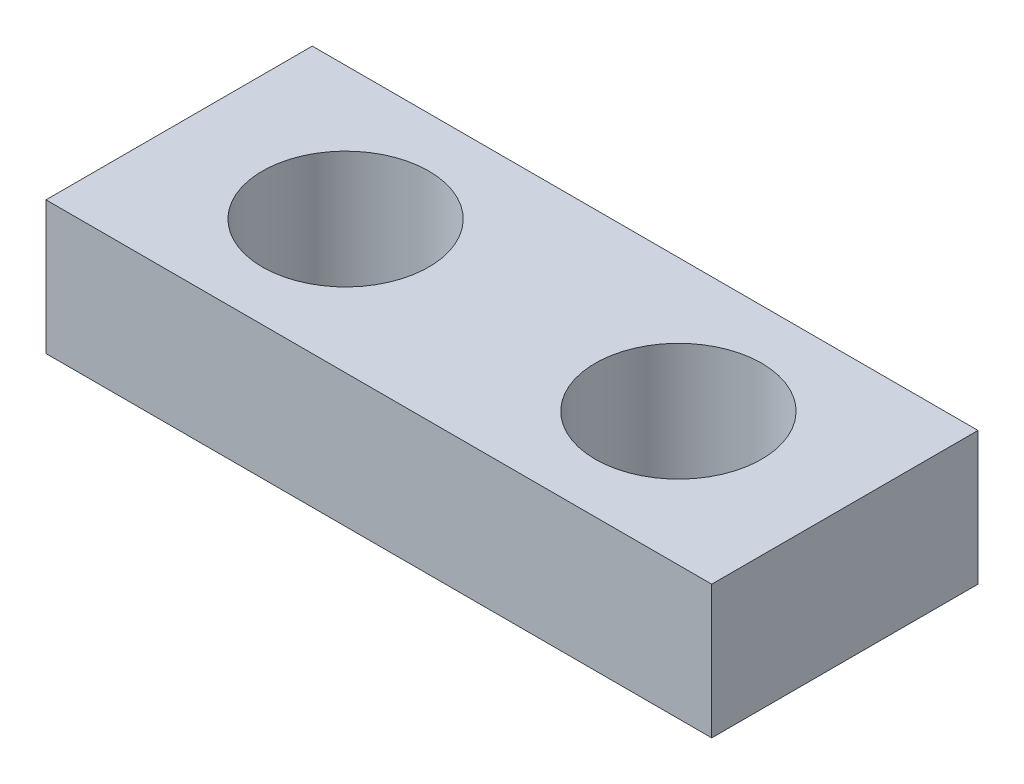
ISO-10303-21;
HEADER;
FILE_DESCRIPTION(('STEP AP214'),'2;1');
FILE_NAME('part.step','',(''),(''),'','','');
FILE_SCHEMA(('AUTOMOTIVE_DESIGN { 1 0 10303 214 1 1 1 1 }'));
ENDSEC;
DATA;
#1=APPLICATION_CONTEXT('core data for automotive mechanical design processes');
#2=APPLICATION_PROTOCOL_DEFINITION('international standard','automotive_design',2000,#1);
#3=PRODUCT_CONTEXT('',#1,'mechanical');
#4=PRODUCT('Part','Part','',(#3));
#5=PRODUCT_RELATED_PRODUCT_CATEGORY('part','',(#4));
#6=PRODUCT_DEFINITION_FORMATION('','',#4);
#7=PRODUCT_DEFINITION_CONTEXT('part definition',#1,'design');
#8=PRODUCT_DEFINITION('design','',#6,#7);
#9=PRODUCT_DEFINITION_SHAPE('','',#8);
#10=(LENGTH_UNIT() NAMED_UNIT(*) SI_UNIT(.MILLI.,.METRE.));
#11=(NAMED_UNIT(*) PLANE_ANGLE_UNIT() SI_UNIT($,.RADIAN.));
#12=(NAMED_UNIT(*) SI_UNIT($,.STERADIAN.) SOLID_ANGLE_UNIT());
#13=UNCERTAINTY_MEASURE_WITH_UNIT(LENGTH_MEASURE(1.E-05),#10,'distance_accuracy_value','');
#14=(GEOMETRIC_REPRESENTATION_CONTEXT(3) GLOBAL_UNCERTAINTY_ASSIGNED_CONTEXT((#13)) GLOBAL_UNIT_ASSIGNED_CONTEXT((#10,
#11,#12)) REPRESENTATION_CONTEXT('',''));
#15=CARTESIAN_POINT('',(0.,0.,0.));
#16=DIRECTION('',(0.,0.,1.));
#17=DIRECTION('',(1.,0.,0.));
#18=AXIS2_PLACEMENT_3D('',#15,#16,#17);
#19=CARTESIAN_POINT('',(0.,25.4,0.));
#20=DIRECTION('',(1.,0.,0.));
#21=DIRECTION('',(0.,0.,-1.));
#22=AXIS2_PLACEMENT_3D('',#19,#20,#21);
#23=PLANE('',#22);
#24=DIRECTION('',(0.,0.,1.));
#25=VECTOR('',#24,1.);
#26=CARTESIAN_POINT('',(0.,0.,0.));
#27=LINE('',#26,#25);
#28=CARTESIAN_POINT('',(0.,0.,-50.8));
#29=VERTEX_POINT('',#28);
#30=CARTESIAN_POINT('',(0.,0.,0.));
#31=VERTEX_POINT('',#30);
#32=EDGE_CURVE('E95',#29,#31,#27,.T.);
#33=ORIENTED_EDGE('',*,*,#32,.T.);
#34=DIRECTION('',(0.,-1.,0.));
#35=VECTOR('',#34,1.);
#36=CARTESIAN_POINT('',(0.,25.4,0.));
#37=LINE('',#36,#35);
#38=CARTESIAN_POINT('',(0.,25.4,0.));
#39=VERTEX_POINT('',#38);
#40=EDGE_CURVE('E11',#39,#31,#37,.T.);
#41=ORIENTED_EDGE('',*,*,#40,.F.);
#42=DIRECTION('',(0.,0.,1.));
#43=VECTOR('',#42,1.);
#44=CARTESIAN_POINT('',(0.,25.4,0.));
#45=LINE('',#44,#43);
#46=CARTESIAN_POINT('',(0.,25.4,-50.8));
#47=VERTEX_POINT('',#46);
#48=EDGE_CURVE('E83',#47,#39,#45,.T.);
#49=ORIENTED_EDGE('',*,*,#48,.F.);
#50=DIRECTION('',(0.,-1.,0.));
#51=VECTOR('',#50,1.);
#52=CARTESIAN_POINT('',(0.,25.4,-50.8));
#53=LINE('',#52,#51);
#54=EDGE_CURVE('E91',#47,#29,#53,.T.);
#55=ORIENTED_EDGE('',*,*,#54,.T.);
#56=EDGE_LOOP('',(#33,#41,#49,#55));
#57=FACE_BOUND('',#56,.T.);
#58=ADVANCED_FACE('F32',(#57),#23,.F.);
#59=CARTESIAN_POINT('',(0.,25.4,0.));
#60=DIRECTION('',(0.,0.,-1.));
#61=DIRECTION('',(-1.,0.,0.));
#62=AXIS2_PLACEMENT_3D('',#59,#60,#61);
#63=PLANE('',#62);
#64=DIRECTION('',(1.,0.,0.));
#65=VECTOR('',#64,1.);
#66=CARTESIAN_POINT('',(0.,0.,0.));
#67=LINE('',#66,#65);
#68=CARTESIAN_POINT('',(127.,0.,0.));
#69=VERTEX_POINT('',#68);
#70=EDGE_CURVE('E87',#31,#69,#67,.T.);
#71=ORIENTED_EDGE('',*,*,#70,.T.);
#72=DIRECTION('',(0.,-1.,0.));
#73=VECTOR('',#72,1.);
#74=CARTESIAN_POINT('',(127.,25.4,0.));
#75=LINE('',#74,#73);
#76=CARTESIAN_POINT('',(127.,25.4,0.));
#77=VERTEX_POINT('',#76);
#78=EDGE_CURVE('E40',#77,#69,#75,.T.);
#79=ORIENTED_EDGE('',*,*,#78,.F.);
#80=DIRECTION('',(1.,0.,0.));
#81=VECTOR('',#80,1.);
#82=CARTESIAN_POINT('',(0.,25.4,0.));
#83=LINE('',#82,#81);
#84=EDGE_CURVE('E78',#39,#77,#83,.T.);
#85=ORIENTED_EDGE('',*,*,#84,.F.);
#86=ORIENTED_EDGE('',*,*,#40,.T.);
#87=EDGE_LOOP('',(#71,#79,#85,#86));
#88=FACE_BOUND('',#87,.T.);
#89=ADVANCED_FACE('F86',(#88),#63,.F.);
#90=CARTESIAN_POINT('',(127.,25.4,0.));
#91=DIRECTION('',(-1.,0.,0.));
#92=DIRECTION('',(0.,0.,1.));
#93=AXIS2_PLACEMENT_3D('',#90,#91,#92);
#94=PLANE('',#93);
#95=DIRECTION('',(0.,0.,-1.));
#96=VECTOR('',#95,1.);
#97=CARTESIAN_POINT('',(127.,0.,0.));
#98=LINE('',#97,#96);
#99=CARTESIAN_POINT('',(127.,0.,-50.8));
#100=VERTEX_POINT('',#99);
#101=EDGE_CURVE('E65',#69,#100,#98,.T.);
#102=ORIENTED_EDGE('',*,*,#101,.T.);
#103=DIRECTION('',(0.,-1.,0.));
#104=VECTOR('',#103,1.);
#105=CARTESIAN_POINT('',(127.,25.4,-50.8));
#106=LINE('',#105,#104);
#107=CARTESIAN_POINT('',(127.,25.4,-50.8));
#108=VERTEX_POINT('',#107);
#109=EDGE_CURVE('E88',#108,#100,#106,.T.);
#110=ORIENTED_EDGE('',*,*,#109,.F.);
#111=DIRECTION('',(0.,0.,-1.));
#112=VECTOR('',#111,1.);
#113=CARTESIAN_POINT('',(127.,25.4,0.));
#114=LINE('',#113,#112);
#115=EDGE_CURVE('E81',#77,#108,#114,.T.);
#116=ORIENTED_EDGE('',*,*,#115,.F.);
#117=ORIENTED_EDGE('',*,*,#78,.T.);
#118=EDGE_LOOP('',(#102,#110,#116,#117));
#119=FACE_BOUND('',#118,.T.);
#120=ADVANCED_FACE('F89',(#119),#94,.F.);
#121=CARTESIAN_POINT('',(0.,25.4,-50.8));
#122=DIRECTION('',(0.,0.,1.));
#123=DIRECTION('',(1.,0.,0.));
#124=AXIS2_PLACEMENT_3D('',#121,#122,#123);
#125=PLANE('',#124);
#126=DIRECTION('',(-1.,0.,0.));
#127=VECTOR('',#126,1.);
#128=CARTESIAN_POINT('',(0.,0.,-50.8));
#129=LINE('',#128,#127);
#130=EDGE_CURVE('E71',#100,#29,#129,.T.);
#131=ORIENTED_EDGE('',*,*,#130,.T.);
#132=ORIENTED_EDGE('',*,*,#54,.F.);
#133=DIRECTION('',(-1.,0.,0.));
#134=VECTOR('',#133,1.);
#135=CARTESIAN_POINT('',(0.,25.4,-50.8));
#136=LINE('',#135,#134);
#137=EDGE_CURVE('E48',#108,#47,#136,.T.);
#138=ORIENTED_EDGE('',*,*,#137,.F.);
#139=ORIENTED_EDGE('',*,*,#109,.T.);
#140=EDGE_LOOP('',(#131,#132,#138,#139));
#141=FACE_BOUND('',#140,.T.);
#142=ADVANCED_FACE('F103',(#141),#125,.F.);
#143=CARTESIAN_POINT('',(0.,25.4,0.));
#144=DIRECTION('',(0.,-1.,0.));
#145=DIRECTION('',(0.,0.,-1.));
#146=AXIS2_PLACEMENT_3D('',#143,#144,#145);
#147=PLANE('',#146);
#148=CARTESIAN_POINT('',(95.25,25.4,-25.4));
#149=DIRECTION('',(0.,1.,0.));
#150=DIRECTION('',(0.,0.,1.));
#151=AXIS2_PLACEMENT_3D('',#148,#149,#150);
#152=CIRCLE('',#151,15.875);
#153=CARTESIAN_POINT('',(95.25,25.4,-9.525));
#154=VERTEX_POINT('',#153);
#155=EDGE_CURVE('E115',#154,#154,#152,.T.);
#156=ORIENTED_EDGE('',*,*,#155,.F.);
#157=EDGE_LOOP('',(#156));
#158=FACE_BOUND('',#157,.T.);
#159=CARTESIAN_POINT('',(31.75,25.4,-25.4));
#160=DIRECTION('',(0.,1.,0.));
#161=DIRECTION('',(0.,0.,1.));
#162=AXIS2_PLACEMENT_3D('',#159,#160,#161);
#163=CIRCLE('',#162,15.875);
#164=CARTESIAN_POINT('',(31.75,25.4,-9.525));
#165=VERTEX_POINT('',#164);
#166=EDGE_CURVE('E109',#165,#165,#163,.T.);
#167=ORIENTED_EDGE('',*,*,#166,.F.);
#168=EDGE_LOOP('',(#167));
#169=FACE_BOUND('',#168,.T.);
#170=ORIENTED_EDGE('',*,*,#48,.T.);
#171=ORIENTED_EDGE('',*,*,#84,.T.);
#172=ORIENTED_EDGE('',*,*,#115,.T.);
#173=ORIENTED_EDGE('',*,*,#137,.T.);
#174=EDGE_LOOP('',(#170,#171,#172,#173));
#175=FACE_BOUND('',#174,.T.);
#176=ADVANCED_FACE('F79',(#158,#169,#175),#147,.F.);
#177=CARTESIAN_POINT('',(0.,0.,0.));
#178=DIRECTION('',(0.,-1.,0.));
#179=DIRECTION('',(0.,0.,-1.));
#180=AXIS2_PLACEMENT_3D('',#177,#178,#179);
#181=PLANE('',#180);
#182=CARTESIAN_POINT('',(95.25,0.,-25.4));
#183=DIRECTION('',(0.,1.,0.));
#184=DIRECTION('',(0.,0.,1.));
#185=AXIS2_PLACEMENT_3D('',#182,#183,#184);
#186=CIRCLE('',#185,15.875);
#187=CARTESIAN_POINT('',(95.25,0.,-9.525));
#188=VERTEX_POINT('',#187);
#189=EDGE_CURVE('E112',#188,#188,#186,.T.);
#190=ORIENTED_EDGE('',*,*,#189,.T.);
#191=EDGE_LOOP('',(#190));
#192=FACE_BOUND('',#191,.T.);
#193=CARTESIAN_POINT('',(31.75,0.,-25.4));
#194=DIRECTION('',(0.,1.,0.));
#195=DIRECTION('',(0.,0.,1.));
#196=AXIS2_PLACEMENT_3D('',#193,#194,#195);
#197=CIRCLE('',#196,15.875);
#198=CARTESIAN_POINT('',(31.75,0.,-9.525));
#199=VERTEX_POINT('',#198);
#200=EDGE_CURVE('E98',#199,#199,#197,.T.);
#201=ORIENTED_EDGE('',*,*,#200,.T.);
#202=EDGE_LOOP('',(#201));
#203=FACE_BOUND('',#202,.T.);
#204=ORIENTED_EDGE('',*,*,#32,.F.);
#205=ORIENTED_EDGE('',*,*,#130,.F.);
#206=ORIENTED_EDGE('',*,*,#101,.F.);
#207=ORIENTED_EDGE('',*,*,#70,.F.);
#208=EDGE_LOOP('',(#204,#205,#206,#207));
#209=FACE_BOUND('',#208,.T.);
#210=ADVANCED_FACE('F106',(#192,#203,#209),#181,.T.);
#211=CARTESIAN_POINT('',(31.75,0.,-25.4));
#212=DIRECTION('',(0.,1.,0.));
#213=DIRECTION('',(0.,0.,1.));
#214=AXIS2_PLACEMENT_3D('',#211,#212,#213);
#215=CYLINDRICAL_SURFACE('',#214,15.875);
#216=ORIENTED_EDGE('',*,*,#200,.F.);
#217=EDGE_LOOP('',(#216));
#218=FACE_BOUND('',#217,.T.);
#219=ORIENTED_EDGE('',*,*,#166,.T.);
#220=EDGE_LOOP('',(#219));
#221=FACE_BOUND('',#220,.T.);
#222=ADVANCED_FACE('F126',(#218,#221),#215,.F.);
#223=CARTESIAN_POINT('',(95.25,0.,-25.4));
#224=DIRECTION('',(0.,1.,0.));
#225=DIRECTION('',(0.,0.,1.));
#226=AXIS2_PLACEMENT_3D('',#223,#224,#225);
#227=CYLINDRICAL_SURFACE('',#226,15.875);
#228=ORIENTED_EDGE('',*,*,#189,.F.);
#229=EDGE_LOOP('',(#228));
#230=FACE_BOUND('',#229,.T.);
#231=ORIENTED_EDGE('',*,*,#155,.T.);
#232=EDGE_LOOP('',(#231));
#233=FACE_BOUND('',#232,.T.);
#234=ADVANCED_FACE('F123',(#230,#233),#227,.F.);
#235=CLOSED_SHELL('',(#58,#89,#120,#142,#176,#210,#222,#234));
#236=MANIFOLD_SOLID_BREP('B2',#235);
#237=ADVANCED_BREP_SHAPE_REPRESENTATION('',(#18,#236),#14);
#238=SHAPE_DEFINITION_REPRESENTATION(#9,#237);
ENDSEC;
END-ISO-10303-21;
